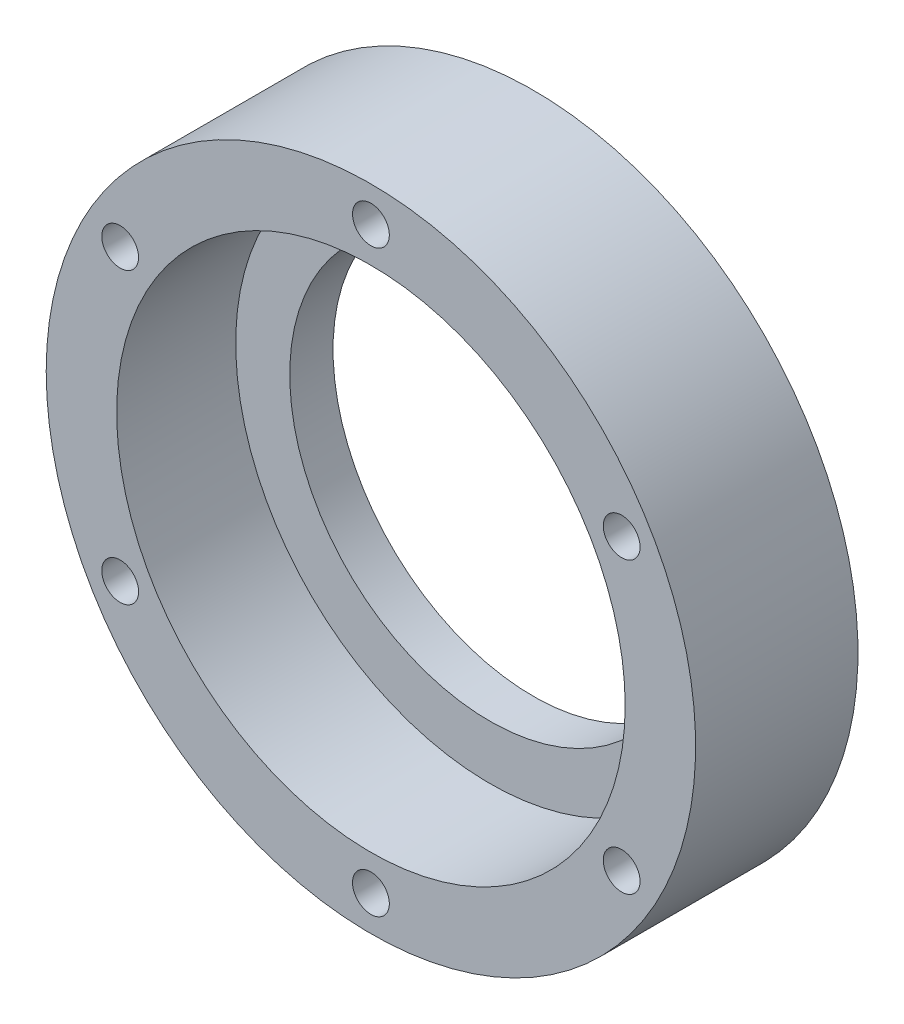
ISO-10303-21;
HEADER;
FILE_DESCRIPTION(('STEP AP214'),'2;1');
FILE_NAME('part.step','',(''),(''),'','','');
FILE_SCHEMA(('AUTOMOTIVE_DESIGN { 1 0 10303 214 1 1 1 1 }'));
ENDSEC;
DATA;
#1=APPLICATION_CONTEXT('core data for automotive mechanical design processes');
#2=APPLICATION_PROTOCOL_DEFINITION('international standard','automotive_design',2000,#1);
#3=PRODUCT_CONTEXT('',#1,'mechanical');
#4=PRODUCT('Part','Part','',(#3));
#5=PRODUCT_RELATED_PRODUCT_CATEGORY('part','',(#4));
#6=PRODUCT_DEFINITION_FORMATION('','',#4);
#7=PRODUCT_DEFINITION_CONTEXT('part definition',#1,'design');
#8=PRODUCT_DEFINITION('design','',#6,#7);
#9=PRODUCT_DEFINITION_SHAPE('','',#8);
#10=(LENGTH_UNIT() NAMED_UNIT(*) SI_UNIT(.MILLI.,.METRE.));
#11=(NAMED_UNIT(*) PLANE_ANGLE_UNIT() SI_UNIT($,.RADIAN.));
#12=(NAMED_UNIT(*) SI_UNIT($,.STERADIAN.) SOLID_ANGLE_UNIT());
#13=UNCERTAINTY_MEASURE_WITH_UNIT(LENGTH_MEASURE(1.E-05),#10,'distance_accuracy_value','');
#14=(GEOMETRIC_REPRESENTATION_CONTEXT(3) GLOBAL_UNCERTAINTY_ASSIGNED_CONTEXT((#13)) GLOBAL_UNIT_ASSIGNED_CONTEXT((#10,
#11,#12)) REPRESENTATION_CONTEXT('',''));
#15=CARTESIAN_POINT('',(0.,0.,0.));
#16=DIRECTION('',(0.,0.,1.));
#17=DIRECTION('',(1.,0.,0.));
#18=AXIS2_PLACEMENT_3D('',#15,#16,#17);
#19=CARTESIAN_POINT('',(0.,0.,15.));
#20=DIRECTION('',(0.,0.,-1.));
#21=DIRECTION('',(-1.,0.,0.));
#22=AXIS2_PLACEMENT_3D('',#19,#20,#21);
#23=CYLINDRICAL_SURFACE('',#22,30.);
#24=CARTESIAN_POINT('',(0.,0.,15.));
#25=DIRECTION('',(0.,0.,-1.));
#26=DIRECTION('',(-1.,0.,0.));
#27=AXIS2_PLACEMENT_3D('',#24,#25,#26);
#28=CIRCLE('',#27,30.);
#29=CARTESIAN_POINT('',(-30.,0.,15.));
#30=VERTEX_POINT('',#29);
#31=EDGE_CURVE('E74',#30,#30,#28,.T.);
#32=ORIENTED_EDGE('',*,*,#31,.T.);
#33=EDGE_LOOP('',(#32));
#34=FACE_BOUND('',#33,.T.);
#35=CARTESIAN_POINT('',(0.,0.,0.));
#36=DIRECTION('',(0.,0.,-1.));
#37=DIRECTION('',(-1.,0.,0.));
#38=AXIS2_PLACEMENT_3D('',#35,#36,#37);
#39=CIRCLE('',#38,30.);
#40=CARTESIAN_POINT('',(-30.,0.,0.));
#41=VERTEX_POINT('',#40);
#42=EDGE_CURVE('E77',#41,#41,#39,.T.);
#43=ORIENTED_EDGE('',*,*,#42,.F.);
#44=EDGE_LOOP('',(#43));
#45=FACE_BOUND('',#44,.T.);
#46=ADVANCED_FACE('F30',(#34,#45),#23,.T.);
#47=CARTESIAN_POINT('',(30.,0.,15.));
#48=DIRECTION('',(0.,0.,1.));
#49=DIRECTION('',(1.,0.,0.));
#50=AXIS2_PLACEMENT_3D('',#47,#48,#49);
#51=PLANE('',#50);
#52=CARTESIAN_POINT('',(0.,0.,15.));
#53=DIRECTION('',(0.,0.,1.));
#54=DIRECTION('',(1.,0.,0.));
#55=AXIS2_PLACEMENT_3D('',#52,#53,#54);
#56=CIRCLE('',#55,23.49119);
#57=CARTESIAN_POINT('',(23.49119,0.,15.));
#58=VERTEX_POINT('',#57);
#59=EDGE_CURVE('E107',#58,#58,#56,.T.);
#60=ORIENTED_EDGE('',*,*,#59,.F.);
#61=EDGE_LOOP('',(#60));
#62=FACE_BOUND('',#61,.T.);
#63=CARTESIAN_POINT('',(23.166179551236,-13.3749999999987,15.));
#64=DIRECTION('',(0.,0.,-1.));
#65=DIRECTION('',(-1.,0.,0.));
#66=AXIS2_PLACEMENT_3D('',#63,#64,#65);
#67=CIRCLE('',#66,1.69999999999999);
#68=CARTESIAN_POINT('',(21.466179551236,-13.3749999999987,15.));
#69=VERTEX_POINT('',#68);
#70=EDGE_CURVE('E95',#69,#69,#67,.T.);
#71=ORIENTED_EDGE('',*,*,#70,.T.);
#72=EDGE_LOOP('',(#71));
#73=FACE_BOUND('',#72,.T.);
#74=CARTESIAN_POINT('',(23.1661795512345,13.3750000000013,15.));
#75=DIRECTION('',(0.,0.,-1.));
#76=DIRECTION('',(-1.,0.,0.));
#77=AXIS2_PLACEMENT_3D('',#74,#75,#76);
#78=CIRCLE('',#77,1.69999999999999);
#79=CARTESIAN_POINT('',(21.4661795512345,13.3750000000013,15.));
#80=VERTEX_POINT('',#79);
#81=EDGE_CURVE('E92',#80,#80,#78,.T.);
#82=ORIENTED_EDGE('',*,*,#81,.T.);
#83=EDGE_LOOP('',(#82));
#84=FACE_BOUND('',#83,.T.);
#85=CARTESIAN_POINT('',(0.,26.75,15.));
#86=DIRECTION('',(0.,0.,-1.));
#87=DIRECTION('',(-1.,0.,0.));
#88=AXIS2_PLACEMENT_3D('',#85,#86,#87);
#89=CIRCLE('',#88,1.69999999999999);
#90=CARTESIAN_POINT('',(-1.69999999999999,26.75,15.));
#91=VERTEX_POINT('',#90);
#92=EDGE_CURVE('E89',#91,#91,#89,.T.);
#93=ORIENTED_EDGE('',*,*,#92,.T.);
#94=EDGE_LOOP('',(#93));
#95=FACE_BOUND('',#94,.T.);
#96=CARTESIAN_POINT('',(-23.1661795512315,-13.3750000000013,15.));
#97=DIRECTION('',(0.,0.,-1.));
#98=DIRECTION('',(-1.,0.,0.));
#99=AXIS2_PLACEMENT_3D('',#96,#97,#98);
#100=CIRCLE('',#99,1.69999999999999);
#101=CARTESIAN_POINT('',(-24.8661795512314,-13.3750000000013,15.));
#102=VERTEX_POINT('',#101);
#103=EDGE_CURVE('E86',#102,#102,#100,.T.);
#104=ORIENTED_EDGE('',*,*,#103,.T.);
#105=EDGE_LOOP('',(#104));
#106=FACE_BOUND('',#105,.T.);
#107=CARTESIAN_POINT('',(3.03457104867779E-12,-26.75,15.));
#108=DIRECTION('',(0.,0.,-1.));
#109=DIRECTION('',(-1.,0.,0.));
#110=AXIS2_PLACEMENT_3D('',#107,#108,#109);
#111=CIRCLE('',#110,1.69999999999999);
#112=CARTESIAN_POINT('',(-1.69999999999695,-26.75,15.));
#113=VERTEX_POINT('',#112);
#114=EDGE_CURVE('E83',#113,#113,#111,.T.);
#115=ORIENTED_EDGE('',*,*,#114,.T.);
#116=EDGE_LOOP('',(#115));
#117=FACE_BOUND('',#116,.T.);
#118=CARTESIAN_POINT('',(-23.166179551233,13.3749999999987,15.));
#119=DIRECTION('',(0.,0.,-1.));
#120=DIRECTION('',(-1.,0.,0.));
#121=AXIS2_PLACEMENT_3D('',#118,#119,#120);
#122=CIRCLE('',#121,1.69999999999999);
#123=CARTESIAN_POINT('',(-24.866179551233,13.3749999999987,15.));
#124=VERTEX_POINT('',#123);
#125=EDGE_CURVE('E80',#124,#124,#122,.T.);
#126=ORIENTED_EDGE('',*,*,#125,.T.);
#127=EDGE_LOOP('',(#126));
#128=FACE_BOUND('',#127,.T.);
#129=ORIENTED_EDGE('',*,*,#31,.F.);
#130=EDGE_LOOP('',(#129));
#131=FACE_BOUND('',#130,.T.);
#132=ADVANCED_FACE('F113',(#62,#73,#84,#95,#106,#117,#128,#131),#51,.T.);
#133=CARTESIAN_POINT('',(0.,0.,0.));
#134=DIRECTION('',(0.,0.,-1.));
#135=DIRECTION('',(-1.,0.,0.));
#136=AXIS2_PLACEMENT_3D('',#133,#134,#135);
#137=PLANE('',#136);
#138=CARTESIAN_POINT('',(-23.1661795512315,-13.3750000000013,0.));
#139=DIRECTION('',(0.,0.,-1.));
#140=DIRECTION('',(-1.,0.,0.));
#141=AXIS2_PLACEMENT_3D('',#138,#139,#140);
#142=CIRCLE('',#141,3.15000000006234);
#143=CARTESIAN_POINT('',(-26.3161795512938,-13.3750000000013,0.));
#144=VERTEX_POINT('',#143);
#145=EDGE_CURVE('E53',#144,#144,#142,.F.);
#146=ORIENTED_EDGE('',*,*,#145,.T.);
#147=EDGE_LOOP('',(#146));
#148=FACE_BOUND('',#147,.T.);
#149=CARTESIAN_POINT('',(-23.166179551233,13.3749999999987,0.));
#150=DIRECTION('',(0.,0.,-1.));
#151=DIRECTION('',(-1.,0.,0.));
#152=AXIS2_PLACEMENT_3D('',#149,#150,#151);
#153=CIRCLE('',#152,3.15000000006234);
#154=CARTESIAN_POINT('',(-26.3161795512953,13.3749999999987,0.));
#155=VERTEX_POINT('',#154);
#156=EDGE_CURVE('E56',#155,#155,#153,.F.);
#157=ORIENTED_EDGE('',*,*,#156,.T.);
#158=EDGE_LOOP('',(#157));
#159=FACE_BOUND('',#158,.T.);
#160=CARTESIAN_POINT('',(3.03457104867779E-12,-26.75,0.));
#161=DIRECTION('',(0.,0.,-1.));
#162=DIRECTION('',(-1.,0.,0.));
#163=AXIS2_PLACEMENT_3D('',#160,#161,#162);
#164=CIRCLE('',#163,3.15000000006234);
#165=CARTESIAN_POINT('',(-3.1500000000593,-26.75,0.));
#166=VERTEX_POINT('',#165);
#167=EDGE_CURVE('E59',#166,#166,#164,.F.);
#168=ORIENTED_EDGE('',*,*,#167,.T.);
#169=EDGE_LOOP('',(#168));
#170=FACE_BOUND('',#169,.T.);
#171=CARTESIAN_POINT('',(23.1661795512345,13.3750000000013,0.));
#172=DIRECTION('',(0.,0.,-1.));
#173=DIRECTION('',(-1.,0.,0.));
#174=AXIS2_PLACEMENT_3D('',#171,#172,#173);
#175=CIRCLE('',#174,3.15000000006235);
#176=CARTESIAN_POINT('',(20.0161795511721,13.3750000000013,0.));
#177=VERTEX_POINT('',#176);
#178=EDGE_CURVE('E62',#177,#177,#175,.F.);
#179=ORIENTED_EDGE('',*,*,#178,.T.);
#180=EDGE_LOOP('',(#179));
#181=FACE_BOUND('',#180,.T.);
#182=CARTESIAN_POINT('',(23.166179551236,-13.3749999999987,0.));
#183=DIRECTION('',(0.,0.,-1.));
#184=DIRECTION('',(-1.,0.,0.));
#185=AXIS2_PLACEMENT_3D('',#182,#183,#184);
#186=CIRCLE('',#185,3.15000000006235);
#187=CARTESIAN_POINT('',(20.0161795511737,-13.3749999999987,0.));
#188=VERTEX_POINT('',#187);
#189=EDGE_CURVE('E65',#188,#188,#186,.F.);
#190=ORIENTED_EDGE('',*,*,#189,.T.);
#191=EDGE_LOOP('',(#190));
#192=FACE_BOUND('',#191,.T.);
#193=CARTESIAN_POINT('',(0.,26.75,0.));
#194=DIRECTION('',(0.,0.,-1.));
#195=DIRECTION('',(-1.,0.,0.));
#196=AXIS2_PLACEMENT_3D('',#193,#194,#195);
#197=CIRCLE('',#196,3.15000000006235);
#198=CARTESIAN_POINT('',(-3.15000000006235,26.75,0.));
#199=VERTEX_POINT('',#198);
#200=EDGE_CURVE('E68',#199,#199,#197,.F.);
#201=ORIENTED_EDGE('',*,*,#200,.T.);
#202=EDGE_LOOP('',(#201));
#203=FACE_BOUND('',#202,.T.);
#204=CARTESIAN_POINT('',(0.,0.,0.));
#205=DIRECTION('',(0.,0.,1.));
#206=DIRECTION('',(1.,0.,0.));
#207=AXIS2_PLACEMENT_3D('',#204,#205,#206);
#208=CIRCLE('',#207,18.5);
#209=CARTESIAN_POINT('',(18.5,0.,0.));
#210=VERTEX_POINT('',#209);
#211=EDGE_CURVE('E98',#210,#210,#208,.T.);
#212=ORIENTED_EDGE('',*,*,#211,.T.);
#213=EDGE_LOOP('',(#212));
#214=FACE_BOUND('',#213,.T.);
#215=ORIENTED_EDGE('',*,*,#42,.T.);
#216=EDGE_LOOP('',(#215));
#217=FACE_BOUND('',#216,.T.);
#218=ADVANCED_FACE('F116',(#148,#159,#170,#181,#192,#203,#214,#217),#137,.T.);
#219=CARTESIAN_POINT('',(-23.166179551233,13.3749999999987,0.));
#220=DIRECTION('',(0.,0.,-1.));
#221=DIRECTION('',(-1.,0.,0.));
#222=AXIS2_PLACEMENT_3D('',#219,#220,#221);
#223=CYLINDRICAL_SURFACE('',#222,1.69999999999999);
#224=CARTESIAN_POINT('',(-23.166179551233,13.3749999999987,1.45000000006235));
#225=DIRECTION('',(0.,0.,-1.));
#226=DIRECTION('',(-1.,0.,0.));
#227=AXIS2_PLACEMENT_3D('',#224,#225,#226);
#228=CIRCLE('',#227,1.69999999999999);
#229=CARTESIAN_POINT('',(-24.866179551233,13.3749999999987,1.45000000006235));
#230=VERTEX_POINT('',#229);
#231=EDGE_CURVE('E50',#230,#230,#228,.T.);
#232=ORIENTED_EDGE('',*,*,#231,.T.);
#233=EDGE_LOOP('',(#232));
#234=FACE_BOUND('',#233,.T.);
#235=ORIENTED_EDGE('',*,*,#125,.F.);
#236=EDGE_LOOP('',(#235));
#237=FACE_BOUND('',#236,.T.);
#238=ADVANCED_FACE('F138',(#234,#237),#223,.F.);
#239=CARTESIAN_POINT('',(3.03457104867779E-12,-26.75,0.));
#240=DIRECTION('',(0.,0.,-1.));
#241=DIRECTION('',(-1.,0.,0.));
#242=AXIS2_PLACEMENT_3D('',#239,#240,#241);
#243=CYLINDRICAL_SURFACE('',#242,1.69999999999999);
#244=CARTESIAN_POINT('',(3.03457104867779E-12,-26.75,1.45000000006234));
#245=DIRECTION('',(0.,0.,-1.));
#246=DIRECTION('',(-1.,0.,0.));
#247=AXIS2_PLACEMENT_3D('',#244,#245,#246);
#248=CIRCLE('',#247,1.69999999999999);
#249=CARTESIAN_POINT('',(-1.69999999999695,-26.75,1.45000000006234));
#250=VERTEX_POINT('',#249);
#251=EDGE_CURVE('E45',#250,#250,#248,.T.);
#252=ORIENTED_EDGE('',*,*,#251,.T.);
#253=EDGE_LOOP('',(#252));
#254=FACE_BOUND('',#253,.T.);
#255=ORIENTED_EDGE('',*,*,#114,.F.);
#256=EDGE_LOOP('',(#255));
#257=FACE_BOUND('',#256,.T.);
#258=ADVANCED_FACE('F144',(#254,#257),#243,.F.);
#259=CARTESIAN_POINT('',(-23.1661795512315,-13.3750000000013,0.));
#260=DIRECTION('',(0.,0.,-1.));
#261=DIRECTION('',(-1.,0.,0.));
#262=AXIS2_PLACEMENT_3D('',#259,#260,#261);
#263=CYLINDRICAL_SURFACE('',#262,1.69999999999999);
#264=CARTESIAN_POINT('',(-23.1661795512315,-13.3750000000013,1.45000000006235));
#265=DIRECTION('',(0.,0.,-1.));
#266=DIRECTION('',(-1.,0.,0.));
#267=AXIS2_PLACEMENT_3D('',#264,#265,#266);
#268=CIRCLE('',#267,1.69999999999999);
#269=CARTESIAN_POINT('',(-24.8661795512314,-13.3750000000013,1.45000000006235));
#270=VERTEX_POINT('',#269);
#271=EDGE_CURVE('E71',#270,#270,#268,.T.);
#272=ORIENTED_EDGE('',*,*,#271,.T.);
#273=EDGE_LOOP('',(#272));
#274=FACE_BOUND('',#273,.T.);
#275=ORIENTED_EDGE('',*,*,#103,.F.);
#276=EDGE_LOOP('',(#275));
#277=FACE_BOUND('',#276,.T.);
#278=ADVANCED_FACE('F207',(#274,#277),#263,.F.);
#279=CARTESIAN_POINT('',(0.,26.75,0.));
#280=DIRECTION('',(0.,0.,-1.));
#281=DIRECTION('',(-1.,0.,0.));
#282=AXIS2_PLACEMENT_3D('',#279,#280,#281);
#283=CYLINDRICAL_SURFACE('',#282,1.69999999999999);
#284=CARTESIAN_POINT('',(0.,26.75,1.45000000006235));
#285=DIRECTION('',(0.,0.,-1.));
#286=DIRECTION('',(-1.,0.,0.));
#287=AXIS2_PLACEMENT_3D('',#284,#285,#286);
#288=CIRCLE('',#287,1.69999999999999);
#289=CARTESIAN_POINT('',(-1.69999999999999,26.75,1.45000000006235));
#290=VERTEX_POINT('',#289);
#291=EDGE_CURVE('E10',#290,#290,#288,.T.);
#292=ORIENTED_EDGE('',*,*,#291,.T.);
#293=EDGE_LOOP('',(#292));
#294=FACE_BOUND('',#293,.T.);
#295=ORIENTED_EDGE('',*,*,#92,.F.);
#296=EDGE_LOOP('',(#295));
#297=FACE_BOUND('',#296,.T.);
#298=ADVANCED_FACE('F203',(#294,#297),#283,.F.);
#299=CARTESIAN_POINT('',(23.1661795512345,13.3750000000013,0.));
#300=DIRECTION('',(0.,0.,-1.));
#301=DIRECTION('',(-1.,0.,0.));
#302=AXIS2_PLACEMENT_3D('',#299,#300,#301);
#303=CYLINDRICAL_SURFACE('',#302,1.69999999999999);
#304=CARTESIAN_POINT('',(23.1661795512345,13.3750000000013,1.45000000006235));
#305=DIRECTION('',(0.,0.,-1.));
#306=DIRECTION('',(-1.,0.,0.));
#307=AXIS2_PLACEMENT_3D('',#304,#305,#306);
#308=CIRCLE('',#307,1.69999999999999);
#309=CARTESIAN_POINT('',(21.4661795512345,13.3750000000013,1.45000000006235));
#310=VERTEX_POINT('',#309);
#311=EDGE_CURVE('E41',#310,#310,#308,.T.);
#312=ORIENTED_EDGE('',*,*,#311,.T.);
#313=EDGE_LOOP('',(#312));
#314=FACE_BOUND('',#313,.T.);
#315=ORIENTED_EDGE('',*,*,#81,.F.);
#316=EDGE_LOOP('',(#315));
#317=FACE_BOUND('',#316,.T.);
#318=ADVANCED_FACE('F200',(#314,#317),#303,.F.);
#319=CARTESIAN_POINT('',(23.166179551236,-13.3749999999987,0.));
#320=DIRECTION('',(0.,0.,-1.));
#321=DIRECTION('',(-1.,0.,0.));
#322=AXIS2_PLACEMENT_3D('',#319,#320,#321);
#323=CYLINDRICAL_SURFACE('',#322,1.69999999999999);
#324=CARTESIAN_POINT('',(23.166179551236,-13.3749999999987,1.45000000006235));
#325=DIRECTION('',(0.,0.,-1.));
#326=DIRECTION('',(-1.,0.,0.));
#327=AXIS2_PLACEMENT_3D('',#324,#325,#326);
#328=CIRCLE('',#327,1.69999999999999);
#329=CARTESIAN_POINT('',(21.466179551236,-13.3749999999987,1.45000000006235));
#330=VERTEX_POINT('',#329);
#331=EDGE_CURVE('E37',#330,#330,#328,.T.);
#332=ORIENTED_EDGE('',*,*,#331,.T.);
#333=EDGE_LOOP('',(#332));
#334=FACE_BOUND('',#333,.T.);
#335=ORIENTED_EDGE('',*,*,#70,.F.);
#336=EDGE_LOOP('',(#335));
#337=FACE_BOUND('',#336,.T.);
#338=ADVANCED_FACE('F184',(#334,#337),#323,.F.);
#339=CARTESIAN_POINT('',(0.,0.,15.));
#340=DIRECTION('',(0.,0.,1.));
#341=DIRECTION('',(1.,0.,0.));
#342=AXIS2_PLACEMENT_3D('',#339,#340,#341);
#343=CYLINDRICAL_SURFACE('',#342,18.5);
#344=ORIENTED_EDGE('',*,*,#211,.F.);
#345=EDGE_LOOP('',(#344));
#346=FACE_BOUND('',#345,.T.);
#347=CARTESIAN_POINT('',(0.,0.,4.));
#348=DIRECTION('',(0.,0.,1.));
#349=DIRECTION('',(1.,0.,0.));
#350=AXIS2_PLACEMENT_3D('',#347,#348,#349);
#351=CIRCLE('',#350,18.5);
#352=CARTESIAN_POINT('',(18.5,0.,4.));
#353=VERTEX_POINT('',#352);
#354=EDGE_CURVE('E101',#353,#353,#351,.T.);
#355=ORIENTED_EDGE('',*,*,#354,.T.);
#356=EDGE_LOOP('',(#355));
#357=FACE_BOUND('',#356,.T.);
#358=ADVANCED_FACE('F180',(#346,#357),#343,.F.);
#359=CARTESIAN_POINT('',(18.5,0.,4.));
#360=DIRECTION('',(0.,0.,-1.));
#361=DIRECTION('',(-1.,0.,0.));
#362=AXIS2_PLACEMENT_3D('',#359,#360,#361);
#363=PLANE('',#362);
#364=ORIENTED_EDGE('',*,*,#354,.F.);
#365=EDGE_LOOP('',(#364));
#366=FACE_BOUND('',#365,.T.);
#367=CARTESIAN_POINT('',(0.,0.,4.));
#368=DIRECTION('',(0.,0.,1.));
#369=DIRECTION('',(1.,0.,0.));
#370=AXIS2_PLACEMENT_3D('',#367,#368,#369);
#371=CIRCLE('',#370,23.49119);
#372=CARTESIAN_POINT('',(23.49119,0.,4.));
#373=VERTEX_POINT('',#372);
#374=EDGE_CURVE('E104',#373,#373,#371,.T.);
#375=ORIENTED_EDGE('',*,*,#374,.T.);
#376=EDGE_LOOP('',(#375));
#377=FACE_BOUND('',#376,.T.);
#378=ADVANCED_FACE('F183',(#366,#377),#363,.F.);
#379=CARTESIAN_POINT('',(0.,0.,15.));
#380=DIRECTION('',(0.,0.,1.));
#381=DIRECTION('',(1.,0.,0.));
#382=AXIS2_PLACEMENT_3D('',#379,#380,#381);
#383=CYLINDRICAL_SURFACE('',#382,23.49119);
#384=ORIENTED_EDGE('',*,*,#374,.F.);
#385=EDGE_LOOP('',(#384));
#386=FACE_BOUND('',#385,.T.);
#387=ORIENTED_EDGE('',*,*,#59,.T.);
#388=EDGE_LOOP('',(#387));
#389=FACE_BOUND('',#388,.T.);
#390=ADVANCED_FACE('F111',(#386,#389),#383,.F.);
#391=CARTESIAN_POINT('',(-23.1661795512315,-13.3750000000013,1.45000000006235));
#392=DIRECTION('',(0.,0.,-1.));
#393=DIRECTION('',(-1.,0.,0.));
#394=AXIS2_PLACEMENT_3D('',#391,#392,#393);
#395=CONICAL_SURFACE('',#394,1.69999999999999,0.78539816339745);
#396=ORIENTED_EDGE('',*,*,#145,.F.);
#397=EDGE_LOOP('',(#396));
#398=FACE_BOUND('',#397,.T.);
#399=ORIENTED_EDGE('',*,*,#271,.F.);
#400=EDGE_LOOP('',(#399));
#401=FACE_BOUND('',#400,.T.);
#402=ADVANCED_FACE('F150',(#398,#401),#395,.F.);
#403=CARTESIAN_POINT('',(-23.166179551233,13.3749999999987,1.45000000006235));
#404=DIRECTION('',(0.,0.,-1.));
#405=DIRECTION('',(-1.,0.,0.));
#406=AXIS2_PLACEMENT_3D('',#403,#404,#405);
#407=CONICAL_SURFACE('',#406,1.69999999999999,0.78539816339745);
#408=ORIENTED_EDGE('',*,*,#156,.F.);
#409=EDGE_LOOP('',(#408));
#410=FACE_BOUND('',#409,.T.);
#411=ORIENTED_EDGE('',*,*,#231,.F.);
#412=EDGE_LOOP('',(#411));
#413=FACE_BOUND('',#412,.T.);
#414=ADVANCED_FACE('F153',(#410,#413),#407,.F.);
#415=CARTESIAN_POINT('',(3.03457104867779E-12,-26.75,1.45000000006234));
#416=DIRECTION('',(0.,0.,-1.));
#417=DIRECTION('',(-1.,0.,0.));
#418=AXIS2_PLACEMENT_3D('',#415,#416,#417);
#419=CONICAL_SURFACE('',#418,1.69999999999999,0.785398163397454);
#420=ORIENTED_EDGE('',*,*,#167,.F.);
#421=EDGE_LOOP('',(#420));
#422=FACE_BOUND('',#421,.T.);
#423=ORIENTED_EDGE('',*,*,#251,.F.);
#424=EDGE_LOOP('',(#423));
#425=FACE_BOUND('',#424,.T.);
#426=ADVANCED_FACE('F157',(#422,#425),#419,.F.);
#427=CARTESIAN_POINT('',(23.1661795512345,13.3750000000013,1.45000000006235));
#428=DIRECTION('',(0.,0.,-1.));
#429=DIRECTION('',(-1.,0.,0.));
#430=AXIS2_PLACEMENT_3D('',#427,#428,#429);
#431=CONICAL_SURFACE('',#430,1.69999999999999,0.785398163397451);
#432=ORIENTED_EDGE('',*,*,#178,.F.);
#433=EDGE_LOOP('',(#432));
#434=FACE_BOUND('',#433,.T.);
#435=ORIENTED_EDGE('',*,*,#311,.F.);
#436=EDGE_LOOP('',(#435));
#437=FACE_BOUND('',#436,.T.);
#438=ADVANCED_FACE('F161',(#434,#437),#431,.F.);
#439=CARTESIAN_POINT('',(23.166179551236,-13.3749999999987,1.45000000006235));
#440=DIRECTION('',(0.,0.,-1.));
#441=DIRECTION('',(-1.,0.,0.));
#442=AXIS2_PLACEMENT_3D('',#439,#440,#441);
#443=CONICAL_SURFACE('',#442,1.69999999999999,0.785398163397451);
#444=ORIENTED_EDGE('',*,*,#189,.F.);
#445=EDGE_LOOP('',(#444));
#446=FACE_BOUND('',#445,.T.);
#447=ORIENTED_EDGE('',*,*,#331,.F.);
#448=EDGE_LOOP('',(#447));
#449=FACE_BOUND('',#448,.T.);
#450=ADVANCED_FACE('F164',(#446,#449),#443,.F.);
#451=CARTESIAN_POINT('',(0.,26.75,1.45000000006235));
#452=DIRECTION('',(0.,0.,-1.));
#453=DIRECTION('',(-1.,0.,0.));
#454=AXIS2_PLACEMENT_3D('',#451,#452,#453);
#455=CONICAL_SURFACE('',#454,1.69999999999999,0.785398163397454);
#456=ORIENTED_EDGE('',*,*,#200,.F.);
#457=EDGE_LOOP('',(#456));
#458=FACE_BOUND('',#457,.T.);
#459=ORIENTED_EDGE('',*,*,#291,.F.);
#460=EDGE_LOOP('',(#459));
#461=FACE_BOUND('',#460,.T.);
#462=ADVANCED_FACE('F32',(#458,#461),#455,.F.);
#463=CLOSED_SHELL('',(#46,#132,#218,#238,#258,#278,#298,#318,#338,#358,#378,#390,#402,#414,#426,
#438,#450,#462));
#464=MANIFOLD_SOLID_BREP('B2',#463);
#465=ADVANCED_BREP_SHAPE_REPRESENTATION('',(#18,#464),#14);
#466=SHAPE_DEFINITION_REPRESENTATION(#9,#465);
ENDSEC;
END-ISO-10303-21;
